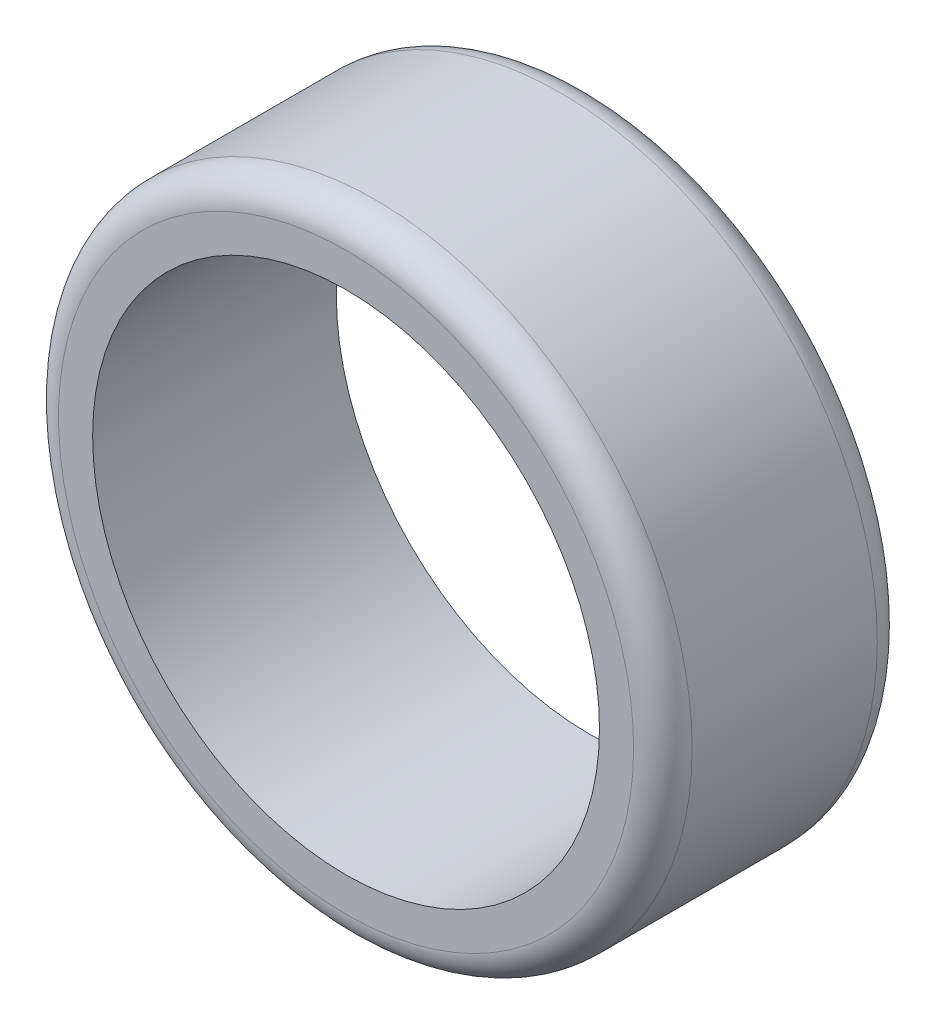
ISO-10303-21;
HEADER;
FILE_DESCRIPTION(('STEP AP214'),'2;1');
FILE_NAME('part.step','',(''),(''),'','','');
FILE_SCHEMA(('AUTOMOTIVE_DESIGN { 1 0 10303 214 1 1 1 1 }'));
ENDSEC;
DATA;
#1=APPLICATION_CONTEXT('core data for automotive mechanical design processes');
#2=APPLICATION_PROTOCOL_DEFINITION('international standard','automotive_design',2000,#1);
#3=PRODUCT_CONTEXT('',#1,'mechanical');
#4=PRODUCT('Part','Part','',(#3));
#5=PRODUCT_RELATED_PRODUCT_CATEGORY('part','',(#4));
#6=PRODUCT_DEFINITION_FORMATION('','',#4);
#7=PRODUCT_DEFINITION_CONTEXT('part definition',#1,'design');
#8=PRODUCT_DEFINITION('design','',#6,#7);
#9=PRODUCT_DEFINITION_SHAPE('','',#8);
#10=(LENGTH_UNIT() NAMED_UNIT(*) SI_UNIT(.MILLI.,.METRE.));
#11=(NAMED_UNIT(*) PLANE_ANGLE_UNIT() SI_UNIT($,.RADIAN.));
#12=(NAMED_UNIT(*) SI_UNIT($,.STERADIAN.) SOLID_ANGLE_UNIT());
#13=UNCERTAINTY_MEASURE_WITH_UNIT(LENGTH_MEASURE(1.E-05),#10,'distance_accuracy_value','');
#14=(GEOMETRIC_REPRESENTATION_CONTEXT(3) GLOBAL_UNCERTAINTY_ASSIGNED_CONTEXT((#13)) GLOBAL_UNIT_ASSIGNED_CONTEXT((#10,
#11,#12)) REPRESENTATION_CONTEXT('',''));
#15=CARTESIAN_POINT('',(0.,0.,0.));
#16=DIRECTION('',(0.,0.,1.));
#17=DIRECTION('',(1.,0.,0.));
#18=AXIS2_PLACEMENT_3D('',#15,#16,#17);
#19=CARTESIAN_POINT('',(0.,0.,12.5));
#20=DIRECTION('',(0.,0.,1.));
#21=DIRECTION('',(1.,0.,0.));
#22=AXIS2_PLACEMENT_3D('',#19,#20,#21);
#23=PLANE('',#22);
#24=CARTESIAN_POINT('',(0.,0.,12.5));
#25=DIRECTION('',(0.,0.,1.));
#26=DIRECTION('',(1.,0.,0.));
#27=AXIS2_PLACEMENT_3D('',#24,#25,#26);
#28=CIRCLE('',#27,29.5);
#29=CARTESIAN_POINT('',(29.5,0.,12.5));
#30=VERTEX_POINT('',#29);
#31=EDGE_CURVE('E10',#30,#30,#28,.T.);
#32=ORIENTED_EDGE('',*,*,#31,.T.);
#33=EDGE_LOOP('',(#32));
#34=FACE_BOUND('',#33,.T.);
#35=CARTESIAN_POINT('',(0.,0.,12.5));
#36=DIRECTION('',(0.,0.,1.));
#37=DIRECTION('',(1.,0.,0.));
#38=AXIS2_PLACEMENT_3D('',#35,#36,#37);
#39=CIRCLE('',#38,26.);
#40=CARTESIAN_POINT('',(26.,0.,12.5));
#41=VERTEX_POINT('',#40);
#42=EDGE_CURVE('E50',#41,#41,#39,.T.);
#43=ORIENTED_EDGE('',*,*,#42,.F.);
#44=EDGE_LOOP('',(#43));
#45=FACE_BOUND('',#44,.T.);
#46=ADVANCED_FACE('F30',(#34,#45),#23,.T.);
#47=CARTESIAN_POINT('',(0.,0.,-12.5));
#48=DIRECTION('',(0.,0.,1.));
#49=DIRECTION('',(1.,0.,0.));
#50=AXIS2_PLACEMENT_3D('',#47,#48,#49);
#51=PLANE('',#50);
#52=CARTESIAN_POINT('',(0.,0.,-12.5));
#53=DIRECTION('',(0.,0.,1.));
#54=DIRECTION('',(1.,0.,0.));
#55=AXIS2_PLACEMENT_3D('',#52,#53,#54);
#56=CIRCLE('',#55,29.5);
#57=CARTESIAN_POINT('',(29.5,0.,-12.5));
#58=VERTEX_POINT('',#57);
#59=EDGE_CURVE('E37',#58,#58,#56,.F.);
#60=ORIENTED_EDGE('',*,*,#59,.T.);
#61=EDGE_LOOP('',(#60));
#62=FACE_BOUND('',#61,.T.);
#63=CARTESIAN_POINT('',(0.,0.,-12.5));
#64=DIRECTION('',(0.,0.,1.));
#65=DIRECTION('',(1.,0.,0.));
#66=AXIS2_PLACEMENT_3D('',#63,#64,#65);
#67=CIRCLE('',#66,26.);
#68=CARTESIAN_POINT('',(26.,0.,-12.5));
#69=VERTEX_POINT('',#68);
#70=EDGE_CURVE('E51',#69,#69,#67,.T.);
#71=ORIENTED_EDGE('',*,*,#70,.T.);
#72=EDGE_LOOP('',(#71));
#73=FACE_BOUND('',#72,.T.);
#74=ADVANCED_FACE('F61',(#62,#73),#51,.F.);
#75=CARTESIAN_POINT('',(0.,0.,12.5));
#76=DIRECTION('',(0.,0.,-1.));
#77=DIRECTION('',(-1.,0.,0.));
#78=AXIS2_PLACEMENT_3D('',#75,#76,#77);
#79=CYLINDRICAL_SURFACE('',#78,32.5);
#80=CARTESIAN_POINT('',(0.,0.,-9.5));
#81=DIRECTION('',(0.,0.,1.));
#82=DIRECTION('',(1.,0.,0.));
#83=AXIS2_PLACEMENT_3D('',#80,#81,#82);
#84=CIRCLE('',#83,32.5);
#85=CARTESIAN_POINT('',(32.5,0.,-9.5));
#86=VERTEX_POINT('',#85);
#87=EDGE_CURVE('E41',#86,#86,#84,.T.);
#88=ORIENTED_EDGE('',*,*,#87,.T.);
#89=EDGE_LOOP('',(#88));
#90=FACE_BOUND('',#89,.T.);
#91=CARTESIAN_POINT('',(0.,0.,9.5));
#92=DIRECTION('',(0.,0.,1.));
#93=DIRECTION('',(1.,0.,0.));
#94=AXIS2_PLACEMENT_3D('',#91,#92,#93);
#95=CIRCLE('',#94,32.5);
#96=CARTESIAN_POINT('',(32.5,0.,9.5));
#97=VERTEX_POINT('',#96);
#98=EDGE_CURVE('E45',#97,#97,#95,.F.);
#99=ORIENTED_EDGE('',*,*,#98,.T.);
#100=EDGE_LOOP('',(#99));
#101=FACE_BOUND('',#100,.T.);
#102=ADVANCED_FACE('F66',(#90,#101),#79,.T.);
#103=CARTESIAN_POINT('',(0.,0.,12.5));
#104=DIRECTION('',(0.,0.,-1.));
#105=DIRECTION('',(-1.,0.,0.));
#106=AXIS2_PLACEMENT_3D('',#103,#104,#105);
#107=CYLINDRICAL_SURFACE('',#106,26.);
#108=ORIENTED_EDGE('',*,*,#42,.T.);
#109=EDGE_LOOP('',(#108));
#110=FACE_BOUND('',#109,.T.);
#111=ORIENTED_EDGE('',*,*,#70,.F.);
#112=EDGE_LOOP('',(#111));
#113=FACE_BOUND('',#112,.T.);
#114=ADVANCED_FACE('F57',(#110,#113),#107,.F.);
#115=CARTESIAN_POINT('',(0.,0.,-9.5));
#116=DIRECTION('',(0.,0.,1.));
#117=DIRECTION('',(1.,0.,0.));
#118=AXIS2_PLACEMENT_3D('',#115,#116,#117);
#119=TOROIDAL_SURFACE('',#118,29.5,3.);
#120=ORIENTED_EDGE('',*,*,#59,.F.);
#121=EDGE_LOOP('',(#120));
#122=FACE_BOUND('',#121,.T.);
#123=ORIENTED_EDGE('',*,*,#87,.F.);
#124=EDGE_LOOP('',(#123));
#125=FACE_BOUND('',#124,.T.);
#126=ADVANCED_FACE('F72',(#122,#125),#119,.T.);
#127=CARTESIAN_POINT('',(0.,0.,9.5));
#128=DIRECTION('',(0.,0.,1.));
#129=DIRECTION('',(1.,0.,0.));
#130=AXIS2_PLACEMENT_3D('',#127,#128,#129);
#131=TOROIDAL_SURFACE('',#130,29.5,3.);
#132=ORIENTED_EDGE('',*,*,#98,.F.);
#133=EDGE_LOOP('',(#132));
#134=FACE_BOUND('',#133,.T.);
#135=ORIENTED_EDGE('',*,*,#31,.F.);
#136=EDGE_LOOP('',(#135));
#137=FACE_BOUND('',#136,.T.);
#138=ADVANCED_FACE('F32',(#134,#137),#131,.T.);
#139=CLOSED_SHELL('',(#46,#74,#102,#114,#126,#138));
#140=MANIFOLD_SOLID_BREP('B2',#139);
#141=ADVANCED_BREP_SHAPE_REPRESENTATION('',(#18,#140),#14);
#142=SHAPE_DEFINITION_REPRESENTATION(#9,#141);
ENDSEC;
END-ISO-10303-21;
